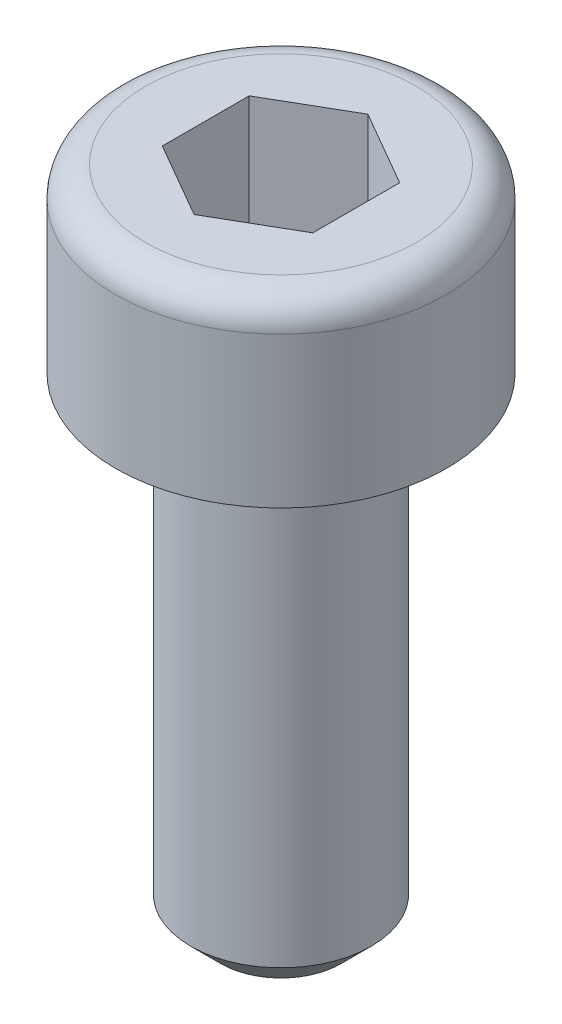
ISO-10303-21;
HEADER;
FILE_DESCRIPTION(('STEP AP214'),'2;1');
FILE_NAME('part.step','',(''),(''),'','','');
FILE_SCHEMA(('AUTOMOTIVE_DESIGN { 1 0 10303 214 1 1 1 1 }'));
ENDSEC;
DATA;
#1=APPLICATION_CONTEXT('core data for automotive mechanical design processes');
#2=APPLICATION_PROTOCOL_DEFINITION('international standard','automotive_design',2000,#1);
#3=PRODUCT_CONTEXT('',#1,'mechanical');
#4=PRODUCT('Part','Part','',(#3));
#5=PRODUCT_RELATED_PRODUCT_CATEGORY('part','',(#4));
#6=PRODUCT_DEFINITION_FORMATION('','',#4);
#7=PRODUCT_DEFINITION_CONTEXT('part definition',#1,'design');
#8=PRODUCT_DEFINITION('design','',#6,#7);
#9=PRODUCT_DEFINITION_SHAPE('','',#8);
#10=(LENGTH_UNIT() NAMED_UNIT(*) SI_UNIT(.MILLI.,.METRE.));
#11=(NAMED_UNIT(*) PLANE_ANGLE_UNIT() SI_UNIT($,.RADIAN.));
#12=(NAMED_UNIT(*) SI_UNIT($,.STERADIAN.) SOLID_ANGLE_UNIT());
#13=UNCERTAINTY_MEASURE_WITH_UNIT(LENGTH_MEASURE(1.E-05),#10,'distance_accuracy_value','');
#14=(GEOMETRIC_REPRESENTATION_CONTEXT(3) GLOBAL_UNCERTAINTY_ASSIGNED_CONTEXT((#13)) GLOBAL_UNIT_ASSIGNED_CONTEXT((#10,
#11,#12)) REPRESENTATION_CONTEXT('',''));
#15=CARTESIAN_POINT('',(0.,0.,0.));
#16=DIRECTION('',(0.,0.,1.));
#17=DIRECTION('',(1.,0.,0.));
#18=AXIS2_PLACEMENT_3D('',#15,#16,#17);
#19=CARTESIAN_POINT('',(0.,0.,0.));
#20=DIRECTION('',(0.,-1.,0.));
#21=DIRECTION('',(0.,0.,-1.));
#22=AXIS2_PLACEMENT_3D('',#19,#20,#21);
#23=PLANE('',#22);
#24=CARTESIAN_POINT('',(0.,0.,0.));
#25=DIRECTION('',(0.,-1.,0.));
#26=DIRECTION('',(0.,0.,-1.));
#27=AXIS2_PLACEMENT_3D('',#24,#25,#26);
#28=CIRCLE('',#27,2.25);
#29=CARTESIAN_POINT('',(0.,0.,-2.25));
#30=VERTEX_POINT('',#29);
#31=EDGE_CURVE('E49',#30,#30,#28,.F.);
#32=ORIENTED_EDGE('',*,*,#31,.T.);
#33=EDGE_LOOP('',(#32));
#34=FACE_BOUND('',#33,.T.);
#35=DIRECTION('',(-0.866025403784439,0.,-0.5));
#36=VECTOR('',#35,1.);
#37=CARTESIAN_POINT('',(1.25,0.,-0.721687836487032));
#38=LINE('',#37,#36);
#39=CARTESIAN_POINT('',(1.25,0.,-0.721687836487032));
#40=VERTEX_POINT('',#39);
#41=CARTESIAN_POINT('',(0.,0.,-1.44337567297406));
#42=VERTEX_POINT('',#41);
#43=EDGE_CURVE('E149',#40,#42,#38,.T.);
#44=ORIENTED_EDGE('',*,*,#43,.F.);
#45=DIRECTION('',(0.,0.,-1.));
#46=VECTOR('',#45,1.);
#47=CARTESIAN_POINT('',(1.25,0.,0.721687836487033));
#48=LINE('',#47,#46);
#49=CARTESIAN_POINT('',(1.25,0.,0.721687836487033));
#50=VERTEX_POINT('',#49);
#51=EDGE_CURVE('E58',#50,#40,#48,.T.);
#52=ORIENTED_EDGE('',*,*,#51,.F.);
#53=DIRECTION('',(0.866025403784439,0.,-0.5));
#54=VECTOR('',#53,1.);
#55=CARTESIAN_POINT('',(0.,0.,1.44337567297406));
#56=LINE('',#55,#54);
#57=CARTESIAN_POINT('',(0.,0.,1.44337567297406));
#58=VERTEX_POINT('',#57);
#59=EDGE_CURVE('E162',#58,#50,#56,.T.);
#60=ORIENTED_EDGE('',*,*,#59,.F.);
#61=DIRECTION('',(0.866025403784439,0.,0.5));
#62=VECTOR('',#61,1.);
#63=CARTESIAN_POINT('',(-1.25,0.,0.721687836487031));
#64=LINE('',#63,#62);
#65=CARTESIAN_POINT('',(-1.25,0.,0.721687836487031));
#66=VERTEX_POINT('',#65);
#67=EDGE_CURVE('E159',#66,#58,#64,.T.);
#68=ORIENTED_EDGE('',*,*,#67,.F.);
#69=DIRECTION('',(0.,0.,1.));
#70=VECTOR('',#69,1.);
#71=CARTESIAN_POINT('',(-1.25,0.,-0.721687836487033));
#72=LINE('',#71,#70);
#73=CARTESIAN_POINT('',(-1.25,0.,-0.721687836487033));
#74=VERTEX_POINT('',#73);
#75=EDGE_CURVE('E116',#74,#66,#72,.T.);
#76=ORIENTED_EDGE('',*,*,#75,.F.);
#77=DIRECTION('',(-0.866025403784439,0.,0.5));
#78=VECTOR('',#77,1.);
#79=CARTESIAN_POINT('',(0.,0.,-1.44337567297406));
#80=LINE('',#79,#78);
#81=EDGE_CURVE('E153',#42,#74,#80,.T.);
#82=ORIENTED_EDGE('',*,*,#81,.F.);
#83=EDGE_LOOP('',(#44,#52,#60,#68,#76,#82));
#84=FACE_BOUND('',#83,.T.);
#85=ADVANCED_FACE('F40',(#34,#84),#23,.F.);
#86=CARTESIAN_POINT('',(0.,0.,0.));
#87=DIRECTION('',(0.,1.,0.));
#88=DIRECTION('',(0.,0.,1.));
#89=AXIS2_PLACEMENT_3D('',#86,#87,#88);
#90=CYLINDRICAL_SURFACE('',#89,2.75);
#91=CARTESIAN_POINT('',(0.,-0.5,0.));
#92=DIRECTION('',(0.,-1.,0.));
#93=DIRECTION('',(0.,0.,-1.));
#94=AXIS2_PLACEMENT_3D('',#91,#92,#93);
#95=CIRCLE('',#94,2.75);
#96=CARTESIAN_POINT('',(0.,-0.5,-2.75));
#97=VERTEX_POINT('',#96);
#98=EDGE_CURVE('E11',#97,#97,#95,.T.);
#99=ORIENTED_EDGE('',*,*,#98,.T.);
#100=EDGE_LOOP('',(#99));
#101=FACE_BOUND('',#100,.T.);
#102=CARTESIAN_POINT('',(0.,-3.,0.));
#103=DIRECTION('',(0.,1.,0.));
#104=DIRECTION('',(0.,0.,1.));
#105=AXIS2_PLACEMENT_3D('',#102,#103,#104);
#106=CIRCLE('',#105,2.75);
#107=CARTESIAN_POINT('',(0.,-3.,2.75));
#108=VERTEX_POINT('',#107);
#109=EDGE_CURVE('E180',#108,#108,#106,.T.);
#110=ORIENTED_EDGE('',*,*,#109,.T.);
#111=EDGE_LOOP('',(#110));
#112=FACE_BOUND('',#111,.T.);
#113=ADVANCED_FACE('F206',(#101,#112),#90,.T.);
#114=CARTESIAN_POINT('',(2.75,-3.,0.));
#115=DIRECTION('',(0.,1.,0.));
#116=DIRECTION('',(0.,0.,1.));
#117=AXIS2_PLACEMENT_3D('',#114,#115,#116);
#118=PLANE('',#117);
#119=ORIENTED_EDGE('',*,*,#109,.F.);
#120=EDGE_LOOP('',(#119));
#121=FACE_BOUND('',#120,.T.);
#122=CARTESIAN_POINT('',(0.,-3.,0.));
#123=DIRECTION('',(0.,1.,0.));
#124=DIRECTION('',(0.,0.,1.));
#125=AXIS2_PLACEMENT_3D('',#122,#123,#124);
#126=CIRCLE('',#125,1.5);
#127=CARTESIAN_POINT('',(0.,-3.,1.5));
#128=VERTEX_POINT('',#127);
#129=EDGE_CURVE('E168',#128,#128,#126,.T.);
#130=ORIENTED_EDGE('',*,*,#129,.T.);
#131=EDGE_LOOP('',(#130));
#132=FACE_BOUND('',#131,.T.);
#133=ADVANCED_FACE('F211',(#121,#132),#118,.F.);
#134=CARTESIAN_POINT('',(0.,0.,0.));
#135=DIRECTION('',(0.,1.,0.));
#136=DIRECTION('',(0.,0.,1.));
#137=AXIS2_PLACEMENT_3D('',#134,#135,#136);
#138=CYLINDRICAL_SURFACE('',#137,1.5);
#139=CARTESIAN_POINT('',(0.,-10.5,0.));
#140=DIRECTION('',(0.,1.,0.));
#141=DIRECTION('',(0.,0.,1.));
#142=AXIS2_PLACEMENT_3D('',#139,#140,#141);
#143=CIRCLE('',#142,1.5);
#144=CARTESIAN_POINT('',(0.,-10.5,1.5));
#145=VERTEX_POINT('',#144);
#146=EDGE_CURVE('E184',#145,#145,#143,.T.);
#147=ORIENTED_EDGE('',*,*,#146,.T.);
#148=EDGE_LOOP('',(#147));
#149=FACE_BOUND('',#148,.T.);
#150=ORIENTED_EDGE('',*,*,#129,.F.);
#151=EDGE_LOOP('',(#150));
#152=FACE_BOUND('',#151,.T.);
#153=ADVANCED_FACE('F217',(#149,#152),#138,.T.);
#154=CARTESIAN_POINT('',(1.5,-11.,0.));
#155=DIRECTION('',(0.,1.,0.));
#156=DIRECTION('',(0.,0.,1.));
#157=AXIS2_PLACEMENT_3D('',#154,#155,#156);
#158=PLANE('',#157);
#159=CARTESIAN_POINT('',(0.,-11.,0.));
#160=DIRECTION('',(0.,1.,0.));
#161=DIRECTION('',(0.,0.,1.));
#162=AXIS2_PLACEMENT_3D('',#159,#160,#161);
#163=CIRCLE('',#162,1.);
#164=CARTESIAN_POINT('',(0.,-11.,1.));
#165=VERTEX_POINT('',#164);
#166=EDGE_CURVE('E188',#165,#165,#163,.F.);
#167=ORIENTED_EDGE('',*,*,#166,.T.);
#168=EDGE_LOOP('',(#167));
#169=FACE_BOUND('',#168,.T.);
#170=ADVANCED_FACE('F221',(#169),#158,.F.);
#171=CARTESIAN_POINT('',(1.25,-2.,0.721687836487033));
#172=DIRECTION('',(1.,0.,0.));
#173=DIRECTION('',(0.,0.,-1.));
#174=AXIS2_PLACEMENT_3D('',#171,#172,#173);
#175=PLANE('',#174);
#176=ORIENTED_EDGE('',*,*,#51,.T.);
#177=DIRECTION('',(0.,1.,0.));
#178=VECTOR('',#177,1.);
#179=CARTESIAN_POINT('',(1.25,-2.,-0.721687836487032));
#180=LINE('',#179,#178);
#181=CARTESIAN_POINT('',(1.25,-2.,-0.721687836487032));
#182=VERTEX_POINT('',#181);
#183=EDGE_CURVE('E96',#182,#40,#180,.T.);
#184=ORIENTED_EDGE('',*,*,#183,.F.);
#185=DIRECTION('',(0.,0.,-1.));
#186=VECTOR('',#185,1.);
#187=CARTESIAN_POINT('',(1.25,-2.,0.721687836487033));
#188=LINE('',#187,#186);
#189=CARTESIAN_POINT('',(1.25,-2.,0.721687836487033));
#190=VERTEX_POINT('',#189);
#191=EDGE_CURVE('E165',#190,#182,#188,.T.);
#192=ORIENTED_EDGE('',*,*,#191,.F.);
#193=DIRECTION('',(0.,1.,0.));
#194=VECTOR('',#193,1.);
#195=CARTESIAN_POINT('',(1.25,-2.,0.721687836487033));
#196=LINE('',#195,#194);
#197=EDGE_CURVE('E69',#190,#50,#196,.T.);
#198=ORIENTED_EDGE('',*,*,#197,.T.);
#199=EDGE_LOOP('',(#176,#184,#192,#198));
#200=FACE_BOUND('',#199,.T.);
#201=ADVANCED_FACE('F225',(#200),#175,.F.);
#202=CARTESIAN_POINT('',(0.,-2.,1.44337567297406));
#203=DIRECTION('',(0.5,0.,0.866025403784439));
#204=DIRECTION('',(0.866025403784439,0.,-0.5));
#205=AXIS2_PLACEMENT_3D('',#202,#203,#204);
#206=PLANE('',#205);
#207=ORIENTED_EDGE('',*,*,#59,.T.);
#208=ORIENTED_EDGE('',*,*,#197,.F.);
#209=DIRECTION('',(0.866025403784439,0.,-0.5));
#210=VECTOR('',#209,1.);
#211=CARTESIAN_POINT('',(0.,-2.,1.44337567297406));
#212=LINE('',#211,#210);
#213=CARTESIAN_POINT('',(0.,-2.,1.44337567297406));
#214=VERTEX_POINT('',#213);
#215=EDGE_CURVE('E130',#214,#190,#212,.T.);
#216=ORIENTED_EDGE('',*,*,#215,.F.);
#217=DIRECTION('',(0.,1.,0.));
#218=VECTOR('',#217,1.);
#219=CARTESIAN_POINT('',(0.,-2.,1.44337567297406));
#220=LINE('',#219,#218);
#221=EDGE_CURVE('E121',#214,#58,#220,.T.);
#222=ORIENTED_EDGE('',*,*,#221,.T.);
#223=EDGE_LOOP('',(#207,#208,#216,#222));
#224=FACE_BOUND('',#223,.T.);
#225=ADVANCED_FACE('F229',(#224),#206,.F.);
#226=CARTESIAN_POINT('',(-1.25,-2.,0.721687836487031));
#227=DIRECTION('',(-0.5,0.,0.866025403784439));
#228=DIRECTION('',(0.866025403784439,0.,0.5));
#229=AXIS2_PLACEMENT_3D('',#226,#227,#228);
#230=PLANE('',#229);
#231=ORIENTED_EDGE('',*,*,#67,.T.);
#232=ORIENTED_EDGE('',*,*,#221,.F.);
#233=DIRECTION('',(0.866025403784439,0.,0.5));
#234=VECTOR('',#233,1.);
#235=CARTESIAN_POINT('',(-1.25,-2.,0.721687836487031));
#236=LINE('',#235,#234);
#237=CARTESIAN_POINT('',(-1.25,-2.,0.721687836487031));
#238=VERTEX_POINT('',#237);
#239=EDGE_CURVE('E125',#238,#214,#236,.T.);
#240=ORIENTED_EDGE('',*,*,#239,.F.);
#241=DIRECTION('',(0.,1.,0.));
#242=VECTOR('',#241,1.);
#243=CARTESIAN_POINT('',(-1.25,-2.,0.721687836487031));
#244=LINE('',#243,#242);
#245=EDGE_CURVE('E109',#238,#66,#244,.T.);
#246=ORIENTED_EDGE('',*,*,#245,.T.);
#247=EDGE_LOOP('',(#231,#232,#240,#246));
#248=FACE_BOUND('',#247,.T.);
#249=ADVANCED_FACE('F126',(#248),#230,.F.);
#250=CARTESIAN_POINT('',(-1.25,-2.,-0.721687836487033));
#251=DIRECTION('',(-1.,0.,0.));
#252=DIRECTION('',(0.,0.,1.));
#253=AXIS2_PLACEMENT_3D('',#250,#251,#252);
#254=PLANE('',#253);
#255=ORIENTED_EDGE('',*,*,#75,.T.);
#256=ORIENTED_EDGE('',*,*,#245,.F.);
#257=DIRECTION('',(0.,0.,1.));
#258=VECTOR('',#257,1.);
#259=CARTESIAN_POINT('',(-1.25,-2.,-0.721687836487033));
#260=LINE('',#259,#258);
#261=CARTESIAN_POINT('',(-1.25,-2.,-0.721687836487033));
#262=VERTEX_POINT('',#261);
#263=EDGE_CURVE('E113',#262,#238,#260,.T.);
#264=ORIENTED_EDGE('',*,*,#263,.F.);
#265=DIRECTION('',(0.,1.,0.));
#266=VECTOR('',#265,1.);
#267=CARTESIAN_POINT('',(-1.25,-2.,-0.721687836487033));
#268=LINE('',#267,#266);
#269=EDGE_CURVE('E122',#262,#74,#268,.T.);
#270=ORIENTED_EDGE('',*,*,#269,.T.);
#271=EDGE_LOOP('',(#255,#256,#264,#270));
#272=FACE_BOUND('',#271,.T.);
#273=ADVANCED_FACE('F111',(#272),#254,.F.);
#274=CARTESIAN_POINT('',(0.,-2.,-1.44337567297406));
#275=DIRECTION('',(-0.5,0.,-0.866025403784439));
#276=DIRECTION('',(-0.866025403784439,0.,0.5));
#277=AXIS2_PLACEMENT_3D('',#274,#275,#276);
#278=PLANE('',#277);
#279=ORIENTED_EDGE('',*,*,#81,.T.);
#280=ORIENTED_EDGE('',*,*,#269,.F.);
#281=DIRECTION('',(-0.866025403784439,0.,0.5));
#282=VECTOR('',#281,1.);
#283=CARTESIAN_POINT('',(0.,-2.,-1.44337567297406));
#284=LINE('',#283,#282);
#285=CARTESIAN_POINT('',(0.,-2.,-1.44337567297406));
#286=VERTEX_POINT('',#285);
#287=EDGE_CURVE('E136',#286,#262,#284,.T.);
#288=ORIENTED_EDGE('',*,*,#287,.F.);
#289=DIRECTION('',(0.,1.,0.));
#290=VECTOR('',#289,1.);
#291=CARTESIAN_POINT('',(0.,-2.,-1.44337567297406));
#292=LINE('',#291,#290);
#293=EDGE_CURVE('E172',#286,#42,#292,.T.);
#294=ORIENTED_EDGE('',*,*,#293,.T.);
#295=EDGE_LOOP('',(#279,#280,#288,#294));
#296=FACE_BOUND('',#295,.T.);
#297=ADVANCED_FACE('F233',(#296),#278,.F.);
#298=CARTESIAN_POINT('',(1.25,-2.,-0.721687836487032));
#299=DIRECTION('',(0.5,0.,-0.866025403784439));
#300=DIRECTION('',(-0.866025403784439,0.,-0.5));
#301=AXIS2_PLACEMENT_3D('',#298,#299,#300);
#302=PLANE('',#301);
#303=ORIENTED_EDGE('',*,*,#43,.T.);
#304=ORIENTED_EDGE('',*,*,#293,.F.);
#305=DIRECTION('',(-0.866025403784439,0.,-0.5));
#306=VECTOR('',#305,1.);
#307=CARTESIAN_POINT('',(1.25,-2.,-0.721687836487032));
#308=LINE('',#307,#306);
#309=EDGE_CURVE('E141',#182,#286,#308,.T.);
#310=ORIENTED_EDGE('',*,*,#309,.F.);
#311=ORIENTED_EDGE('',*,*,#183,.T.);
#312=EDGE_LOOP('',(#303,#304,#310,#311));
#313=FACE_BOUND('',#312,.T.);
#314=ADVANCED_FACE('F230',(#313),#302,.F.);
#315=CARTESIAN_POINT('',(1.25,-2.,-0.721687836487032));
#316=DIRECTION('',(0.,1.,0.));
#317=DIRECTION('',(0.,0.,1.));
#318=AXIS2_PLACEMENT_3D('',#315,#316,#317);
#319=PLANE('',#318);
#320=ORIENTED_EDGE('',*,*,#191,.T.);
#321=ORIENTED_EDGE('',*,*,#309,.T.);
#322=ORIENTED_EDGE('',*,*,#287,.T.);
#323=ORIENTED_EDGE('',*,*,#263,.T.);
#324=ORIENTED_EDGE('',*,*,#239,.T.);
#325=ORIENTED_EDGE('',*,*,#215,.T.);
#326=EDGE_LOOP('',(#320,#321,#322,#323,#324,#325));
#327=FACE_BOUND('',#326,.T.);
#328=ADVANCED_FACE('F133',(#327),#319,.T.);
#329=CARTESIAN_POINT('',(0.,-10.5,0.));
#330=DIRECTION('',(0.,1.,0.));
#331=DIRECTION('',(0.,0.,1.));
#332=AXIS2_PLACEMENT_3D('',#329,#330,#331);
#333=CONICAL_SURFACE('',#332,1.5,0.785398163397449);
#334=ORIENTED_EDGE('',*,*,#166,.F.);
#335=EDGE_LOOP('',(#334));
#336=FACE_BOUND('',#335,.T.);
#337=ORIENTED_EDGE('',*,*,#146,.F.);
#338=EDGE_LOOP('',(#337));
#339=FACE_BOUND('',#338,.T.);
#340=ADVANCED_FACE('F198',(#336,#339),#333,.T.);
#341=CARTESIAN_POINT('',(0.,-0.5,0.));
#342=DIRECTION('',(0.,-1.,0.));
#343=DIRECTION('',(0.,0.,-1.));
#344=AXIS2_PLACEMENT_3D('',#341,#342,#343);
#345=TOROIDAL_SURFACE('',#344,2.25,0.5);
#346=ORIENTED_EDGE('',*,*,#98,.F.);
#347=EDGE_LOOP('',(#346));
#348=FACE_BOUND('',#347,.T.);
#349=ORIENTED_EDGE('',*,*,#31,.F.);
#350=EDGE_LOOP('',(#349));
#351=FACE_BOUND('',#350,.T.);
#352=ADVANCED_FACE('F42',(#348,#351),#345,.T.);
#353=CLOSED_SHELL('',(#85,#113,#133,#153,#170,#201,#225,#249,#273,#297,#314,#328,#340,#352));
#354=MANIFOLD_SOLID_BREP('B2',#353);
#355=ADVANCED_BREP_SHAPE_REPRESENTATION('',(#18,#354),#14);
#356=SHAPE_DEFINITION_REPRESENTATION(#9,#355);
ENDSEC;
END-ISO-10303-21;
